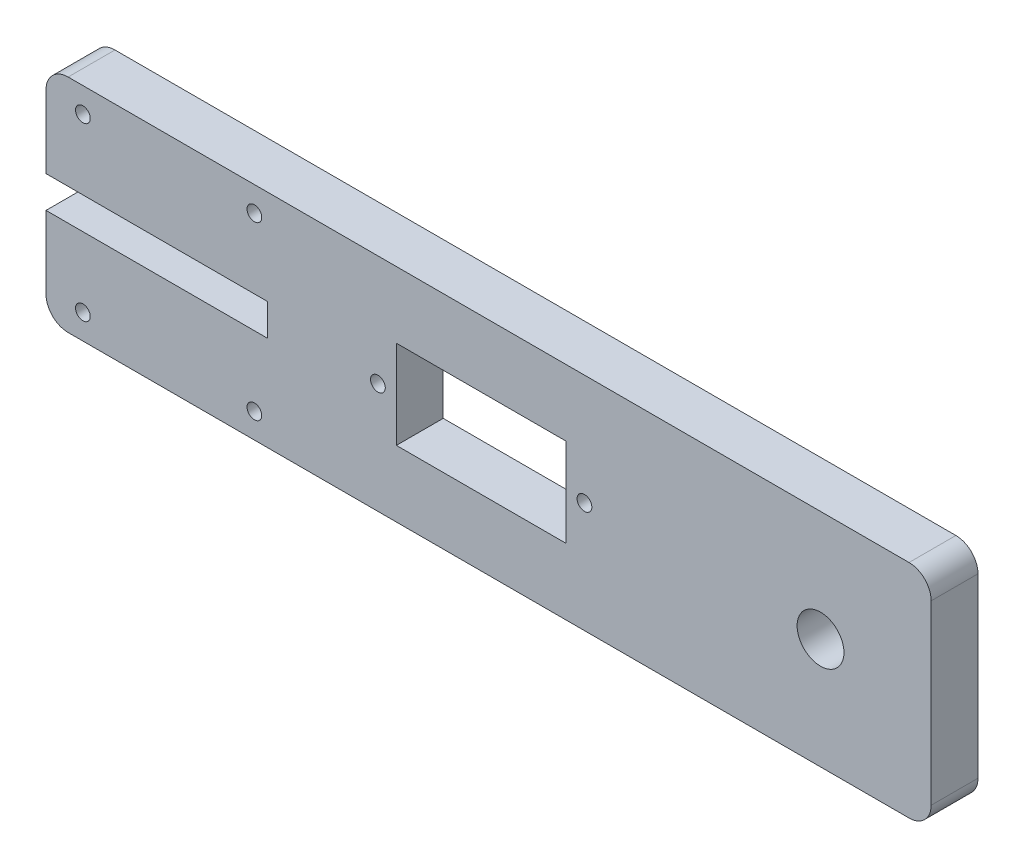
ISO-10303-21;
HEADER;
FILE_DESCRIPTION(('STEP AP214'),'2;1');
FILE_NAME('part.step','',(''),(''),'','','');
FILE_SCHEMA(('AUTOMOTIVE_DESIGN { 1 0 10303 214 1 1 1 1 }'));
ENDSEC;
DATA;
#1=APPLICATION_CONTEXT('core data for automotive mechanical design processes');
#2=APPLICATION_PROTOCOL_DEFINITION('international standard','automotive_design',2000,#1);
#3=PRODUCT_CONTEXT('',#1,'mechanical');
#4=PRODUCT('Part','Part','',(#3));
#5=PRODUCT_RELATED_PRODUCT_CATEGORY('part','',(#4));
#6=PRODUCT_DEFINITION_FORMATION('','',#4);
#7=PRODUCT_DEFINITION_CONTEXT('part definition',#1,'design');
#8=PRODUCT_DEFINITION('design','',#6,#7);
#9=PRODUCT_DEFINITION_SHAPE('','',#8);
#10=(LENGTH_UNIT() NAMED_UNIT(*) SI_UNIT(.MILLI.,.METRE.));
#11=(NAMED_UNIT(*) PLANE_ANGLE_UNIT() SI_UNIT($,.RADIAN.));
#12=(NAMED_UNIT(*) SI_UNIT($,.STERADIAN.) SOLID_ANGLE_UNIT());
#13=UNCERTAINTY_MEASURE_WITH_UNIT(LENGTH_MEASURE(1.E-05),#10,'distance_accuracy_value','');
#14=(GEOMETRIC_REPRESENTATION_CONTEXT(3) GLOBAL_UNCERTAINTY_ASSIGNED_CONTEXT((#13)) GLOBAL_UNIT_ASSIGNED_CONTEXT((#10,
#11,#12)) REPRESENTATION_CONTEXT('',''));
#15=CARTESIAN_POINT('',(0.,0.,0.));
#16=DIRECTION('',(0.,0.,1.));
#17=DIRECTION('',(1.,0.,0.));
#18=AXIS2_PLACEMENT_3D('',#15,#16,#17);
#19=CARTESIAN_POINT('',(0.,0.,6.35));
#20=DIRECTION('',(1.,0.,0.));
#21=DIRECTION('',(0.,0.,-1.));
#22=AXIS2_PLACEMENT_3D('',#19,#20,#21);
#23=PLANE('',#22);
#24=DIRECTION('',(0.,-1.,0.));
#25=VECTOR('',#24,1.);
#26=CARTESIAN_POINT('',(0.,0.,0.));
#27=LINE('',#26,#25);
#28=CARTESIAN_POINT('',(0.,12.841,0.));
#29=VERTEX_POINT('',#28);
#30=CARTESIAN_POINT('',(0.,3.,0.));
#31=VERTEX_POINT('',#30);
#32=EDGE_CURVE('E231',#29,#31,#27,.T.);
#33=ORIENTED_EDGE('',*,*,#32,.T.);
#34=DIRECTION('',(0.,0.,-1.));
#35=VECTOR('',#34,1.);
#36=CARTESIAN_POINT('',(0.,3.,6.35));
#37=LINE('',#36,#35);
#38=CARTESIAN_POINT('',(0.,3.,6.35));
#39=VERTEX_POINT('',#38);
#40=EDGE_CURVE('E290',#31,#39,#37,.F.);
#41=ORIENTED_EDGE('',*,*,#40,.T.);
#42=DIRECTION('',(0.,-1.,0.));
#43=VECTOR('',#42,1.);
#44=CARTESIAN_POINT('',(0.,0.,6.35));
#45=LINE('',#44,#43);
#46=CARTESIAN_POINT('',(0.,12.841,6.35));
#47=VERTEX_POINT('',#46);
#48=EDGE_CURVE('E209',#47,#39,#45,.T.);
#49=ORIENTED_EDGE('',*,*,#48,.F.);
#50=DIRECTION('',(0.,0.,-1.));
#51=VECTOR('',#50,1.);
#52=CARTESIAN_POINT('',(0.,12.841,6.35));
#53=LINE('',#52,#51);
#54=EDGE_CURVE('E230',#47,#29,#53,.T.);
#55=ORIENTED_EDGE('',*,*,#54,.T.);
#56=EDGE_LOOP('',(#33,#41,#49,#55));
#57=FACE_BOUND('',#56,.T.);
#58=ADVANCED_FACE('F37',(#57),#23,.F.);
#59=CARTESIAN_POINT('',(0.,0.,6.35));
#60=DIRECTION('',(0.,1.,0.));
#61=DIRECTION('',(0.,0.,1.));
#62=AXIS2_PLACEMENT_3D('',#59,#60,#61);
#63=PLANE('',#62);
#64=DIRECTION('',(1.,0.,0.));
#65=VECTOR('',#64,1.);
#66=CARTESIAN_POINT('',(0.,0.,6.35));
#67=LINE('',#66,#65);
#68=CARTESIAN_POINT('',(3.,0.,6.35));
#69=VERTEX_POINT('',#68);
#70=CARTESIAN_POINT('',(117.,0.,6.35));
#71=VERTEX_POINT('',#70);
#72=EDGE_CURVE('E212',#69,#71,#67,.T.);
#73=ORIENTED_EDGE('',*,*,#72,.F.);
#74=DIRECTION('',(0.,0.,-1.));
#75=VECTOR('',#74,1.);
#76=CARTESIAN_POINT('',(3.,0.,6.35));
#77=LINE('',#76,#75);
#78=CARTESIAN_POINT('',(3.,0.,0.));
#79=VERTEX_POINT('',#78);
#80=EDGE_CURVE('E287',#69,#79,#77,.T.);
#81=ORIENTED_EDGE('',*,*,#80,.T.);
#82=DIRECTION('',(1.,0.,0.));
#83=VECTOR('',#82,1.);
#84=CARTESIAN_POINT('',(0.,0.,0.));
#85=LINE('',#84,#83);
#86=CARTESIAN_POINT('',(117.,0.,0.));
#87=VERTEX_POINT('',#86);
#88=EDGE_CURVE('E234',#79,#87,#85,.T.);
#89=ORIENTED_EDGE('',*,*,#88,.T.);
#90=DIRECTION('',(0.,0.,-1.));
#91=VECTOR('',#90,1.);
#92=CARTESIAN_POINT('',(117.,0.,6.35));
#93=LINE('',#92,#91);
#94=EDGE_CURVE('E285',#87,#71,#93,.F.);
#95=ORIENTED_EDGE('',*,*,#94,.T.);
#96=EDGE_LOOP('',(#73,#81,#89,#95));
#97=FACE_BOUND('',#96,.T.);
#98=ADVANCED_FACE('F350',(#97),#63,.F.);
#99=CARTESIAN_POINT('',(120.,0.,6.35));
#100=DIRECTION('',(-1.,0.,0.));
#101=DIRECTION('',(0.,0.,1.));
#102=AXIS2_PLACEMENT_3D('',#99,#100,#101);
#103=PLANE('',#102);
#104=DIRECTION('',(0.,1.,0.));
#105=VECTOR('',#104,1.);
#106=CARTESIAN_POINT('',(120.,0.,6.35));
#107=LINE('',#106,#105);
#108=CARTESIAN_POINT('',(120.,3.,6.35));
#109=VERTEX_POINT('',#108);
#110=CARTESIAN_POINT('',(120.,27.,6.35));
#111=VERTEX_POINT('',#110);
#112=EDGE_CURVE('E216',#109,#111,#107,.T.);
#113=ORIENTED_EDGE('',*,*,#112,.F.);
#114=DIRECTION('',(0.,0.,-1.));
#115=VECTOR('',#114,1.);
#116=CARTESIAN_POINT('',(120.,3.,6.35));
#117=LINE('',#116,#115);
#118=CARTESIAN_POINT('',(120.,3.,0.));
#119=VERTEX_POINT('',#118);
#120=EDGE_CURVE('E11',#109,#119,#117,.T.);
#121=ORIENTED_EDGE('',*,*,#120,.T.);
#122=DIRECTION('',(0.,1.,0.));
#123=VECTOR('',#122,1.);
#124=CARTESIAN_POINT('',(120.,0.,0.));
#125=LINE('',#124,#123);
#126=CARTESIAN_POINT('',(120.,27.,0.));
#127=VERTEX_POINT('',#126);
#128=EDGE_CURVE('E237',#119,#127,#125,.T.);
#129=ORIENTED_EDGE('',*,*,#128,.T.);
#130=DIRECTION('',(0.,0.,-1.));
#131=VECTOR('',#130,1.);
#132=CARTESIAN_POINT('',(120.,27.,6.35));
#133=LINE('',#132,#131);
#134=EDGE_CURVE('E46',#127,#111,#133,.F.);
#135=ORIENTED_EDGE('',*,*,#134,.T.);
#136=EDGE_LOOP('',(#113,#121,#129,#135));
#137=FACE_BOUND('',#136,.T.);
#138=ADVANCED_FACE('F341',(#137),#103,.F.);
#139=CARTESIAN_POINT('',(0.,30.,6.35));
#140=DIRECTION('',(0.,-1.,0.));
#141=DIRECTION('',(0.,0.,-1.));
#142=AXIS2_PLACEMENT_3D('',#139,#140,#141);
#143=PLANE('',#142);
#144=DIRECTION('',(-1.,0.,0.));
#145=VECTOR('',#144,1.);
#146=CARTESIAN_POINT('',(0.,30.,0.));
#147=LINE('',#146,#145);
#148=CARTESIAN_POINT('',(117.,30.,0.));
#149=VERTEX_POINT('',#148);
#150=CARTESIAN_POINT('',(3.,30.,0.));
#151=VERTEX_POINT('',#150);
#152=EDGE_CURVE('E240',#149,#151,#147,.T.);
#153=ORIENTED_EDGE('',*,*,#152,.T.);
#154=DIRECTION('',(0.,0.,-1.));
#155=VECTOR('',#154,1.);
#156=CARTESIAN_POINT('',(3.,30.,6.35));
#157=LINE('',#156,#155);
#158=CARTESIAN_POINT('',(3.,30.,6.35));
#159=VERTEX_POINT('',#158);
#160=EDGE_CURVE('E275',#151,#159,#157,.F.);
#161=ORIENTED_EDGE('',*,*,#160,.T.);
#162=DIRECTION('',(-1.,0.,0.));
#163=VECTOR('',#162,1.);
#164=CARTESIAN_POINT('',(0.,30.,6.35));
#165=LINE('',#164,#163);
#166=CARTESIAN_POINT('',(117.,30.,6.35));
#167=VERTEX_POINT('',#166);
#168=EDGE_CURVE('E219',#167,#159,#165,.T.);
#169=ORIENTED_EDGE('',*,*,#168,.F.);
#170=DIRECTION('',(0.,0.,-1.));
#171=VECTOR('',#170,1.);
#172=CARTESIAN_POINT('',(117.,30.,6.35));
#173=LINE('',#172,#171);
#174=EDGE_CURVE('E272',#167,#149,#173,.T.);
#175=ORIENTED_EDGE('',*,*,#174,.T.);
#176=EDGE_LOOP('',(#153,#161,#169,#175));
#177=FACE_BOUND('',#176,.T.);
#178=ADVANCED_FACE('F333',(#177),#143,.F.);
#179=CARTESIAN_POINT('',(0.,17.159,6.35));
#180=DIRECTION('',(1.,0.,0.));
#181=DIRECTION('',(0.,0.,-1.));
#182=AXIS2_PLACEMENT_3D('',#179,#180,#181);
#183=PLANE('',#182);
#184=DIRECTION('',(0.,-1.,0.));
#185=VECTOR('',#184,1.);
#186=CARTESIAN_POINT('',(0.,17.159,6.35));
#187=LINE('',#186,#185);
#188=CARTESIAN_POINT('',(0.,27.,6.35));
#189=VERTEX_POINT('',#188);
#190=CARTESIAN_POINT('',(0.,17.159,6.35));
#191=VERTEX_POINT('',#190);
#192=EDGE_CURVE('E222',#189,#191,#187,.T.);
#193=ORIENTED_EDGE('',*,*,#192,.F.);
#194=DIRECTION('',(0.,0.,-1.));
#195=VECTOR('',#194,1.);
#196=CARTESIAN_POINT('',(0.,27.,6.35));
#197=LINE('',#196,#195);
#198=CARTESIAN_POINT('',(0.,27.,0.));
#199=VERTEX_POINT('',#198);
#200=EDGE_CURVE('E261',#189,#199,#197,.T.);
#201=ORIENTED_EDGE('',*,*,#200,.T.);
#202=DIRECTION('',(0.,-1.,0.));
#203=VECTOR('',#202,1.);
#204=CARTESIAN_POINT('',(0.,17.159,0.));
#205=LINE('',#204,#203);
#206=CARTESIAN_POINT('',(0.,17.159,0.));
#207=VERTEX_POINT('',#206);
#208=EDGE_CURVE('E243',#199,#207,#205,.T.);
#209=ORIENTED_EDGE('',*,*,#208,.T.);
#210=DIRECTION('',(0.,0.,-1.));
#211=VECTOR('',#210,1.);
#212=CARTESIAN_POINT('',(0.,17.159,6.35));
#213=LINE('',#212,#211);
#214=EDGE_CURVE('E258',#191,#207,#213,.T.);
#215=ORIENTED_EDGE('',*,*,#214,.F.);
#216=EDGE_LOOP('',(#193,#201,#209,#215));
#217=FACE_BOUND('',#216,.T.);
#218=ADVANCED_FACE('F319',(#217),#183,.F.);
#219=CARTESIAN_POINT('',(0.,17.159,6.35));
#220=DIRECTION('',(0.,1.,0.));
#221=DIRECTION('',(0.,0.,1.));
#222=AXIS2_PLACEMENT_3D('',#219,#220,#221);
#223=PLANE('',#222);
#224=DIRECTION('',(1.,0.,0.));
#225=VECTOR('',#224,1.);
#226=CARTESIAN_POINT('',(0.,17.159,0.));
#227=LINE('',#226,#225);
#228=CARTESIAN_POINT('',(30.,17.159,0.));
#229=VERTEX_POINT('',#228);
#230=EDGE_CURVE('E245',#207,#229,#227,.T.);
#231=ORIENTED_EDGE('',*,*,#230,.T.);
#232=DIRECTION('',(0.,0.,-1.));
#233=VECTOR('',#232,1.);
#234=CARTESIAN_POINT('',(30.,17.159,6.35));
#235=LINE('',#234,#233);
#236=CARTESIAN_POINT('',(30.,17.159,6.35));
#237=VERTEX_POINT('',#236);
#238=EDGE_CURVE('E255',#237,#229,#235,.T.);
#239=ORIENTED_EDGE('',*,*,#238,.F.);
#240=DIRECTION('',(1.,0.,0.));
#241=VECTOR('',#240,1.);
#242=CARTESIAN_POINT('',(0.,17.159,6.35));
#243=LINE('',#242,#241);
#244=EDGE_CURVE('E224',#191,#237,#243,.T.);
#245=ORIENTED_EDGE('',*,*,#244,.F.);
#246=ORIENTED_EDGE('',*,*,#214,.T.);
#247=EDGE_LOOP('',(#231,#239,#245,#246));
#248=FACE_BOUND('',#247,.T.);
#249=ADVANCED_FACE('F323',(#248),#223,.F.);
#250=CARTESIAN_POINT('',(30.,17.159,6.35));
#251=DIRECTION('',(1.,0.,0.));
#252=DIRECTION('',(0.,0.,-1.));
#253=AXIS2_PLACEMENT_3D('',#250,#251,#252);
#254=PLANE('',#253);
#255=DIRECTION('',(0.,-1.,0.));
#256=VECTOR('',#255,1.);
#257=CARTESIAN_POINT('',(30.,17.159,0.));
#258=LINE('',#257,#256);
#259=CARTESIAN_POINT('',(30.,12.841,0.));
#260=VERTEX_POINT('',#259);
#261=EDGE_CURVE('E247',#229,#260,#258,.T.);
#262=ORIENTED_EDGE('',*,*,#261,.T.);
#263=DIRECTION('',(0.,0.,-1.));
#264=VECTOR('',#263,1.);
#265=CARTESIAN_POINT('',(30.,12.841,6.35));
#266=LINE('',#265,#264);
#267=CARTESIAN_POINT('',(30.,12.841,6.35));
#268=VERTEX_POINT('',#267);
#269=EDGE_CURVE('E252',#268,#260,#266,.T.);
#270=ORIENTED_EDGE('',*,*,#269,.F.);
#271=DIRECTION('',(0.,-1.,0.));
#272=VECTOR('',#271,1.);
#273=CARTESIAN_POINT('',(30.,17.159,6.35));
#274=LINE('',#273,#272);
#275=EDGE_CURVE('E226',#237,#268,#274,.T.);
#276=ORIENTED_EDGE('',*,*,#275,.F.);
#277=ORIENTED_EDGE('',*,*,#238,.T.);
#278=EDGE_LOOP('',(#262,#270,#276,#277));
#279=FACE_BOUND('',#278,.T.);
#280=ADVANCED_FACE('F365',(#279),#254,.F.);
#281=CARTESIAN_POINT('',(0.,12.841,6.35));
#282=DIRECTION('',(0.,-1.,0.));
#283=DIRECTION('',(0.,0.,-1.));
#284=AXIS2_PLACEMENT_3D('',#281,#282,#283);
#285=PLANE('',#284);
#286=DIRECTION('',(-1.,0.,0.));
#287=VECTOR('',#286,1.);
#288=CARTESIAN_POINT('',(0.,12.841,0.));
#289=LINE('',#288,#287);
#290=EDGE_CURVE('E213',#260,#29,#289,.T.);
#291=ORIENTED_EDGE('',*,*,#290,.T.);
#292=ORIENTED_EDGE('',*,*,#54,.F.);
#293=DIRECTION('',(-1.,0.,0.));
#294=VECTOR('',#293,1.);
#295=CARTESIAN_POINT('',(0.,12.841,6.35));
#296=LINE('',#295,#294);
#297=EDGE_CURVE('E228',#268,#47,#296,.T.);
#298=ORIENTED_EDGE('',*,*,#297,.F.);
#299=ORIENTED_EDGE('',*,*,#269,.T.);
#300=EDGE_LOOP('',(#291,#292,#298,#299));
#301=FACE_BOUND('',#300,.T.);
#302=ADVANCED_FACE('F363',(#301),#285,.F.);
#303=CARTESIAN_POINT('',(0.,12.841,6.35));
#304=DIRECTION('',(0.,0.,-1.));
#305=DIRECTION('',(-1.,0.,0.));
#306=AXIS2_PLACEMENT_3D('',#303,#304,#305);
#307=PLANE('',#306);
#308=CARTESIAN_POINT('',(105.,15.,6.35));
#309=DIRECTION('',(0.,0.,1.));
#310=DIRECTION('',(1.,0.,0.));
#311=AXIS2_PLACEMENT_3D('',#308,#309,#310);
#312=CIRCLE('',#311,3.175);
#313=CARTESIAN_POINT('',(108.175,15.,6.35));
#314=VERTEX_POINT('',#313);
#315=EDGE_CURVE('E411',#314,#314,#312,.T.);
#316=ORIENTED_EDGE('',*,*,#315,.F.);
#317=EDGE_LOOP('',(#316));
#318=FACE_BOUND('',#317,.T.);
#319=CARTESIAN_POINT('',(45.,15.,6.35));
#320=DIRECTION('',(0.,0.,1.));
#321=DIRECTION('',(1.,0.,0.));
#322=AXIS2_PLACEMENT_3D('',#319,#320,#321);
#323=CIRCLE('',#322,0.996949999999996);
#324=CARTESIAN_POINT('',(45.99695,15.,6.35));
#325=VERTEX_POINT('',#324);
#326=EDGE_CURVE('E415',#325,#325,#323,.T.);
#327=ORIENTED_EDGE('',*,*,#326,.F.);
#328=EDGE_LOOP('',(#327));
#329=FACE_BOUND('',#328,.T.);
#330=CARTESIAN_POINT('',(73.,15.,6.35));
#331=DIRECTION('',(0.,0.,1.));
#332=DIRECTION('',(1.,0.,0.));
#333=AXIS2_PLACEMENT_3D('',#330,#331,#332);
#334=CIRCLE('',#333,0.996949999999996);
#335=CARTESIAN_POINT('',(73.99695,15.,6.35));
#336=VERTEX_POINT('',#335);
#337=EDGE_CURVE('E419',#336,#336,#334,.T.);
#338=ORIENTED_EDGE('',*,*,#337,.F.);
#339=EDGE_LOOP('',(#338));
#340=FACE_BOUND('',#339,.T.);
#341=DIRECTION('',(1.,0.,0.));
#342=VECTOR('',#341,1.);
#343=CARTESIAN_POINT('',(47.5,9.,6.35));
#344=LINE('',#343,#342);
#345=CARTESIAN_POINT('',(47.5,9.,6.35));
#346=VERTEX_POINT('',#345);
#347=CARTESIAN_POINT('',(70.5,9.,6.35));
#348=VERTEX_POINT('',#347);
#349=EDGE_CURVE('E182',#346,#348,#344,.T.);
#350=ORIENTED_EDGE('',*,*,#349,.F.);
#351=DIRECTION('',(0.,-1.,0.));
#352=VECTOR('',#351,1.);
#353=CARTESIAN_POINT('',(47.5,21.,6.35));
#354=LINE('',#353,#352);
#355=CARTESIAN_POINT('',(47.5,21.,6.35));
#356=VERTEX_POINT('',#355);
#357=EDGE_CURVE('E54',#356,#346,#354,.T.);
#358=ORIENTED_EDGE('',*,*,#357,.F.);
#359=DIRECTION('',(-1.,0.,0.));
#360=VECTOR('',#359,1.);
#361=CARTESIAN_POINT('',(47.5,21.,6.35));
#362=LINE('',#361,#360);
#363=CARTESIAN_POINT('',(70.5,21.,6.35));
#364=VERTEX_POINT('',#363);
#365=EDGE_CURVE('E170',#364,#356,#362,.T.);
#366=ORIENTED_EDGE('',*,*,#365,.F.);
#367=DIRECTION('',(0.,1.,0.));
#368=VECTOR('',#367,1.);
#369=CARTESIAN_POINT('',(70.5,21.,6.35));
#370=LINE('',#369,#368);
#371=EDGE_CURVE('E173',#348,#364,#370,.T.);
#372=ORIENTED_EDGE('',*,*,#371,.F.);
#373=EDGE_LOOP('',(#350,#358,#366,#372));
#374=FACE_BOUND('',#373,.T.);
#375=CARTESIAN_POINT('',(4.99999999999999,26.625,6.35));
#376=DIRECTION('',(0.,0.,1.));
#377=DIRECTION('',(1.,0.,0.));
#378=AXIS2_PLACEMENT_3D('',#375,#376,#377);
#379=CIRCLE('',#378,0.996949999999998);
#380=CARTESIAN_POINT('',(5.99694999999999,26.625,6.35));
#381=VERTEX_POINT('',#380);
#382=EDGE_CURVE('E188',#381,#381,#379,.T.);
#383=ORIENTED_EDGE('',*,*,#382,.F.);
#384=EDGE_LOOP('',(#383));
#385=FACE_BOUND('',#384,.T.);
#386=CARTESIAN_POINT('',(28.25,26.625,6.35));
#387=DIRECTION('',(0.,0.,1.));
#388=DIRECTION('',(1.,0.,0.));
#389=AXIS2_PLACEMENT_3D('',#386,#387,#388);
#390=CIRCLE('',#389,0.99695);
#391=CARTESIAN_POINT('',(29.24695,26.625,6.35));
#392=VERTEX_POINT('',#391);
#393=EDGE_CURVE('E197',#392,#392,#390,.T.);
#394=ORIENTED_EDGE('',*,*,#393,.F.);
#395=EDGE_LOOP('',(#394));
#396=FACE_BOUND('',#395,.T.);
#397=CARTESIAN_POINT('',(28.25,3.375,6.35));
#398=DIRECTION('',(0.,0.,1.));
#399=DIRECTION('',(1.,0.,0.));
#400=AXIS2_PLACEMENT_3D('',#397,#398,#399);
#401=CIRCLE('',#400,0.99695);
#402=CARTESIAN_POINT('',(29.24695,3.375,6.35));
#403=VERTEX_POINT('',#402);
#404=EDGE_CURVE('E201',#403,#403,#401,.T.);
#405=ORIENTED_EDGE('',*,*,#404,.F.);
#406=EDGE_LOOP('',(#405));
#407=FACE_BOUND('',#406,.T.);
#408=CARTESIAN_POINT('',(4.99999999999999,3.375,6.35));
#409=DIRECTION('',(0.,0.,1.));
#410=DIRECTION('',(1.,0.,0.));
#411=AXIS2_PLACEMENT_3D('',#408,#409,#410);
#412=CIRCLE('',#411,0.996949999999998);
#413=CARTESIAN_POINT('',(5.99694999999999,3.375,6.35));
#414=VERTEX_POINT('',#413);
#415=EDGE_CURVE('E205',#414,#414,#412,.T.);
#416=ORIENTED_EDGE('',*,*,#415,.F.);
#417=EDGE_LOOP('',(#416));
#418=FACE_BOUND('',#417,.T.);
#419=ORIENTED_EDGE('',*,*,#168,.T.);
#420=CARTESIAN_POINT('',(3.,27.,6.35));
#421=DIRECTION('',(0.,0.,-1.));
#422=DIRECTION('',(-1.,0.,0.));
#423=AXIS2_PLACEMENT_3D('',#420,#421,#422);
#424=CIRCLE('',#423,3.);
#425=EDGE_CURVE('E283',#159,#189,#424,.F.);
#426=ORIENTED_EDGE('',*,*,#425,.T.);
#427=ORIENTED_EDGE('',*,*,#192,.T.);
#428=ORIENTED_EDGE('',*,*,#244,.T.);
#429=ORIENTED_EDGE('',*,*,#275,.T.);
#430=ORIENTED_EDGE('',*,*,#297,.T.);
#431=ORIENTED_EDGE('',*,*,#48,.T.);
#432=CARTESIAN_POINT('',(3.,3.,6.35));
#433=DIRECTION('',(0.,0.,-1.));
#434=DIRECTION('',(-1.,0.,0.));
#435=AXIS2_PLACEMENT_3D('',#432,#433,#434);
#436=CIRCLE('',#435,3.);
#437=EDGE_CURVE('E281',#39,#69,#436,.F.);
#438=ORIENTED_EDGE('',*,*,#437,.T.);
#439=ORIENTED_EDGE('',*,*,#72,.T.);
#440=CARTESIAN_POINT('',(117.,3.,6.35));
#441=DIRECTION('',(0.,0.,-1.));
#442=DIRECTION('',(-1.,0.,0.));
#443=AXIS2_PLACEMENT_3D('',#440,#441,#442);
#444=CIRCLE('',#443,3.);
#445=EDGE_CURVE('E279',#71,#109,#444,.F.);
#446=ORIENTED_EDGE('',*,*,#445,.T.);
#447=ORIENTED_EDGE('',*,*,#112,.T.);
#448=CARTESIAN_POINT('',(117.,27.,6.35));
#449=DIRECTION('',(0.,0.,-1.));
#450=DIRECTION('',(-1.,0.,0.));
#451=AXIS2_PLACEMENT_3D('',#448,#449,#450);
#452=CIRCLE('',#451,3.);
#453=EDGE_CURVE('E277',#111,#167,#452,.F.);
#454=ORIENTED_EDGE('',*,*,#453,.T.);
#455=EDGE_LOOP('',(#419,#426,#427,#428,#429,#430,#431,#438,#439,#446,#447,#454));
#456=FACE_BOUND('',#455,.T.);
#457=ADVANCED_FACE('F305',(#318,#329,#340,#374,#385,#396,#407,#418,#456),#307,.F.);
#458=CARTESIAN_POINT('',(0.,12.841,0.));
#459=DIRECTION('',(0.,0.,-1.));
#460=DIRECTION('',(-1.,0.,0.));
#461=AXIS2_PLACEMENT_3D('',#458,#459,#460);
#462=PLANE('',#461);
#463=CARTESIAN_POINT('',(105.,15.,0.));
#464=DIRECTION('',(0.,0.,-1.));
#465=DIRECTION('',(-1.,0.,0.));
#466=AXIS2_PLACEMENT_3D('',#463,#464,#465);
#467=CIRCLE('',#466,3.175);
#468=CARTESIAN_POINT('',(101.825,15.,0.));
#469=VERTEX_POINT('',#468);
#470=EDGE_CURVE('E41',#469,#469,#467,.T.);
#471=ORIENTED_EDGE('',*,*,#470,.F.);
#472=EDGE_LOOP('',(#471));
#473=FACE_BOUND('',#472,.T.);
#474=CARTESIAN_POINT('',(45.,15.,0.));
#475=DIRECTION('',(0.,0.,1.));
#476=DIRECTION('',(1.,0.,0.));
#477=AXIS2_PLACEMENT_3D('',#474,#475,#476);
#478=CIRCLE('',#477,0.996949999999996);
#479=CARTESIAN_POINT('',(45.99695,15.,0.));
#480=VERTEX_POINT('',#479);
#481=EDGE_CURVE('E468',#480,#480,#478,.T.);
#482=ORIENTED_EDGE('',*,*,#481,.T.);
#483=EDGE_LOOP('',(#482));
#484=FACE_BOUND('',#483,.T.);
#485=CARTESIAN_POINT('',(73.,15.,0.));
#486=DIRECTION('',(0.,0.,1.));
#487=DIRECTION('',(1.,0.,0.));
#488=AXIS2_PLACEMENT_3D('',#485,#486,#487);
#489=CIRCLE('',#488,0.996949999999996);
#490=CARTESIAN_POINT('',(73.99695,15.,0.));
#491=VERTEX_POINT('',#490);
#492=EDGE_CURVE('E176',#491,#491,#489,.T.);
#493=ORIENTED_EDGE('',*,*,#492,.T.);
#494=EDGE_LOOP('',(#493));
#495=FACE_BOUND('',#494,.T.);
#496=DIRECTION('',(0.,-1.,0.));
#497=VECTOR('',#496,1.);
#498=CARTESIAN_POINT('',(47.5,21.,0.));
#499=LINE('',#498,#497);
#500=CARTESIAN_POINT('',(47.5,21.,0.));
#501=VERTEX_POINT('',#500);
#502=CARTESIAN_POINT('',(47.5,9.,0.));
#503=VERTEX_POINT('',#502);
#504=EDGE_CURVE('E154',#501,#503,#499,.T.);
#505=ORIENTED_EDGE('',*,*,#504,.T.);
#506=DIRECTION('',(1.,0.,0.));
#507=VECTOR('',#506,1.);
#508=CARTESIAN_POINT('',(47.5,9.,0.));
#509=LINE('',#508,#507);
#510=CARTESIAN_POINT('',(70.5,9.,0.));
#511=VERTEX_POINT('',#510);
#512=EDGE_CURVE('E163',#503,#511,#509,.T.);
#513=ORIENTED_EDGE('',*,*,#512,.T.);
#514=DIRECTION('',(0.,1.,0.));
#515=VECTOR('',#514,1.);
#516=CARTESIAN_POINT('',(70.5,21.,0.));
#517=LINE('',#516,#515);
#518=CARTESIAN_POINT('',(70.5,21.,0.));
#519=VERTEX_POINT('',#518);
#520=EDGE_CURVE('E62',#511,#519,#517,.T.);
#521=ORIENTED_EDGE('',*,*,#520,.T.);
#522=DIRECTION('',(-1.,0.,0.));
#523=VECTOR('',#522,1.);
#524=CARTESIAN_POINT('',(47.5,21.,0.));
#525=LINE('',#524,#523);
#526=EDGE_CURVE('E160',#519,#501,#525,.T.);
#527=ORIENTED_EDGE('',*,*,#526,.T.);
#528=EDGE_LOOP('',(#505,#513,#521,#527));
#529=FACE_BOUND('',#528,.T.);
#530=CARTESIAN_POINT('',(4.99999999999999,26.625,0.));
#531=DIRECTION('',(0.,0.,-1.));
#532=DIRECTION('',(-1.,0.,0.));
#533=AXIS2_PLACEMENT_3D('',#530,#531,#532);
#534=CIRCLE('',#533,0.996949999999998);
#535=CARTESIAN_POINT('',(4.00305,26.625,0.));
#536=VERTEX_POINT('',#535);
#537=EDGE_CURVE('E194',#536,#536,#534,.T.);
#538=ORIENTED_EDGE('',*,*,#537,.F.);
#539=EDGE_LOOP('',(#538));
#540=FACE_BOUND('',#539,.T.);
#541=CARTESIAN_POINT('',(28.25,26.625,0.));
#542=DIRECTION('',(0.,0.,-1.));
#543=DIRECTION('',(-1.,0.,0.));
#544=AXIS2_PLACEMENT_3D('',#541,#542,#543);
#545=CIRCLE('',#544,0.996949999999998);
#546=CARTESIAN_POINT('',(27.25305,26.625,0.));
#547=VERTEX_POINT('',#546);
#548=EDGE_CURVE('E200',#547,#547,#545,.T.);
#549=ORIENTED_EDGE('',*,*,#548,.F.);
#550=EDGE_LOOP('',(#549));
#551=FACE_BOUND('',#550,.T.);
#552=CARTESIAN_POINT('',(28.25,3.375,0.));
#553=DIRECTION('',(0.,0.,-1.));
#554=DIRECTION('',(-1.,0.,0.));
#555=AXIS2_PLACEMENT_3D('',#552,#553,#554);
#556=CIRCLE('',#555,0.996949999999998);
#557=CARTESIAN_POINT('',(27.25305,3.375,0.));
#558=VERTEX_POINT('',#557);
#559=EDGE_CURVE('E204',#558,#558,#556,.T.);
#560=ORIENTED_EDGE('',*,*,#559,.F.);
#561=EDGE_LOOP('',(#560));
#562=FACE_BOUND('',#561,.T.);
#563=CARTESIAN_POINT('',(4.99999999999999,3.375,0.));
#564=DIRECTION('',(0.,0.,-1.));
#565=DIRECTION('',(-1.,0.,0.));
#566=AXIS2_PLACEMENT_3D('',#563,#564,#565);
#567=CIRCLE('',#566,0.996949999999998);
#568=CARTESIAN_POINT('',(4.00305,3.375,0.));
#569=VERTEX_POINT('',#568);
#570=EDGE_CURVE('E208',#569,#569,#567,.T.);
#571=ORIENTED_EDGE('',*,*,#570,.F.);
#572=EDGE_LOOP('',(#571));
#573=FACE_BOUND('',#572,.T.);
#574=ORIENTED_EDGE('',*,*,#208,.F.);
#575=CARTESIAN_POINT('',(3.,27.,0.));
#576=DIRECTION('',(0.,0.,-1.));
#577=DIRECTION('',(-1.,0.,0.));
#578=AXIS2_PLACEMENT_3D('',#575,#576,#577);
#579=CIRCLE('',#578,3.);
#580=EDGE_CURVE('E270',#199,#151,#579,.T.);
#581=ORIENTED_EDGE('',*,*,#580,.T.);
#582=ORIENTED_EDGE('',*,*,#152,.F.);
#583=CARTESIAN_POINT('',(117.,27.,0.));
#584=DIRECTION('',(0.,0.,-1.));
#585=DIRECTION('',(-1.,0.,0.));
#586=AXIS2_PLACEMENT_3D('',#583,#584,#585);
#587=CIRCLE('',#586,3.);
#588=EDGE_CURVE('E264',#149,#127,#587,.T.);
#589=ORIENTED_EDGE('',*,*,#588,.T.);
#590=ORIENTED_EDGE('',*,*,#128,.F.);
#591=CARTESIAN_POINT('',(117.,3.,0.));
#592=DIRECTION('',(0.,0.,-1.));
#593=DIRECTION('',(-1.,0.,0.));
#594=AXIS2_PLACEMENT_3D('',#591,#592,#593);
#595=CIRCLE('',#594,3.);
#596=EDGE_CURVE('E266',#119,#87,#595,.T.);
#597=ORIENTED_EDGE('',*,*,#596,.T.);
#598=ORIENTED_EDGE('',*,*,#88,.F.);
#599=CARTESIAN_POINT('',(3.,3.,0.));
#600=DIRECTION('',(0.,0.,-1.));
#601=DIRECTION('',(-1.,0.,0.));
#602=AXIS2_PLACEMENT_3D('',#599,#600,#601);
#603=CIRCLE('',#602,3.);
#604=EDGE_CURVE('E268',#79,#31,#603,.T.);
#605=ORIENTED_EDGE('',*,*,#604,.T.);
#606=ORIENTED_EDGE('',*,*,#32,.F.);
#607=ORIENTED_EDGE('',*,*,#290,.F.);
#608=ORIENTED_EDGE('',*,*,#261,.F.);
#609=ORIENTED_EDGE('',*,*,#230,.F.);
#610=EDGE_LOOP('',(#574,#581,#582,#589,#590,#597,#598,#605,#606,#607,#608,#609));
#611=FACE_BOUND('',#610,.T.);
#612=ADVANCED_FACE('F167',(#473,#484,#495,#529,#540,#551,#562,#573,#611),#462,.T.);
#613=CARTESIAN_POINT('',(3.,27.,6.35));
#614=DIRECTION('',(0.,0.,-1.));
#615=DIRECTION('',(-1.,0.,0.));
#616=AXIS2_PLACEMENT_3D('',#613,#614,#615);
#617=CYLINDRICAL_SURFACE('',#616,3.);
#618=ORIENTED_EDGE('',*,*,#425,.F.);
#619=ORIENTED_EDGE('',*,*,#160,.F.);
#620=ORIENTED_EDGE('',*,*,#580,.F.);
#621=ORIENTED_EDGE('',*,*,#200,.F.);
#622=EDGE_LOOP('',(#618,#619,#620,#621));
#623=FACE_BOUND('',#622,.T.);
#624=ADVANCED_FACE('F304',(#623),#617,.T.);
#625=CARTESIAN_POINT('',(3.,3.,6.35));
#626=DIRECTION('',(0.,0.,-1.));
#627=DIRECTION('',(-1.,0.,0.));
#628=AXIS2_PLACEMENT_3D('',#625,#626,#627);
#629=CYLINDRICAL_SURFACE('',#628,3.);
#630=ORIENTED_EDGE('',*,*,#437,.F.);
#631=ORIENTED_EDGE('',*,*,#40,.F.);
#632=ORIENTED_EDGE('',*,*,#604,.F.);
#633=ORIENTED_EDGE('',*,*,#80,.F.);
#634=EDGE_LOOP('',(#630,#631,#632,#633));
#635=FACE_BOUND('',#634,.T.);
#636=ADVANCED_FACE('F354',(#635),#629,.T.);
#637=CARTESIAN_POINT('',(117.,3.,6.35));
#638=DIRECTION('',(0.,0.,-1.));
#639=DIRECTION('',(-1.,0.,0.));
#640=AXIS2_PLACEMENT_3D('',#637,#638,#639);
#641=CYLINDRICAL_SURFACE('',#640,3.);
#642=ORIENTED_EDGE('',*,*,#445,.F.);
#643=ORIENTED_EDGE('',*,*,#94,.F.);
#644=ORIENTED_EDGE('',*,*,#596,.F.);
#645=ORIENTED_EDGE('',*,*,#120,.F.);
#646=EDGE_LOOP('',(#642,#643,#644,#645));
#647=FACE_BOUND('',#646,.T.);
#648=ADVANCED_FACE('F345',(#647),#641,.T.);
#649=CARTESIAN_POINT('',(117.,27.,6.35));
#650=DIRECTION('',(0.,0.,-1.));
#651=DIRECTION('',(-1.,0.,0.));
#652=AXIS2_PLACEMENT_3D('',#649,#650,#651);
#653=CYLINDRICAL_SURFACE('',#652,3.);
#654=ORIENTED_EDGE('',*,*,#453,.F.);
#655=ORIENTED_EDGE('',*,*,#134,.F.);
#656=ORIENTED_EDGE('',*,*,#588,.F.);
#657=ORIENTED_EDGE('',*,*,#174,.F.);
#658=EDGE_LOOP('',(#654,#655,#656,#657));
#659=FACE_BOUND('',#658,.T.);
#660=ADVANCED_FACE('F39',(#659),#653,.T.);
#661=CARTESIAN_POINT('',(4.99999999999999,3.375,6.35));
#662=DIRECTION('',(0.,0.,1.));
#663=DIRECTION('',(1.,0.,0.));
#664=AXIS2_PLACEMENT_3D('',#661,#662,#663);
#665=CYLINDRICAL_SURFACE('',#664,0.996949999999998);
#666=ORIENTED_EDGE('',*,*,#570,.T.);
#667=EDGE_LOOP('',(#666));
#668=FACE_BOUND('',#667,.T.);
#669=ORIENTED_EDGE('',*,*,#415,.T.);
#670=EDGE_LOOP('',(#669));
#671=FACE_BOUND('',#670,.T.);
#672=ADVANCED_FACE('F389',(#668,#671),#665,.F.);
#673=CARTESIAN_POINT('',(28.25,3.375,6.35));
#674=DIRECTION('',(0.,0.,1.));
#675=DIRECTION('',(1.,0.,0.));
#676=AXIS2_PLACEMENT_3D('',#673,#674,#675);
#677=CYLINDRICAL_SURFACE('',#676,0.996949999999998);
#678=ORIENTED_EDGE('',*,*,#559,.T.);
#679=EDGE_LOOP('',(#678));
#680=FACE_BOUND('',#679,.T.);
#681=ORIENTED_EDGE('',*,*,#404,.T.);
#682=EDGE_LOOP('',(#681));
#683=FACE_BOUND('',#682,.T.);
#684=ADVANCED_FACE('F393',(#680,#683),#677,.F.);
#685=CARTESIAN_POINT('',(28.25,26.625,6.35));
#686=DIRECTION('',(0.,0.,1.));
#687=DIRECTION('',(1.,0.,0.));
#688=AXIS2_PLACEMENT_3D('',#685,#686,#687);
#689=CYLINDRICAL_SURFACE('',#688,0.996949999999998);
#690=ORIENTED_EDGE('',*,*,#548,.T.);
#691=EDGE_LOOP('',(#690));
#692=FACE_BOUND('',#691,.T.);
#693=ORIENTED_EDGE('',*,*,#393,.T.);
#694=EDGE_LOOP('',(#693));
#695=FACE_BOUND('',#694,.T.);
#696=ADVANCED_FACE('F299',(#692,#695),#689,.F.);
#697=CARTESIAN_POINT('',(4.99999999999999,26.625,6.35));
#698=DIRECTION('',(0.,0.,1.));
#699=DIRECTION('',(1.,0.,0.));
#700=AXIS2_PLACEMENT_3D('',#697,#698,#699);
#701=CYLINDRICAL_SURFACE('',#700,0.996949999999998);
#702=ORIENTED_EDGE('',*,*,#537,.T.);
#703=EDGE_LOOP('',(#702));
#704=FACE_BOUND('',#703,.T.);
#705=ORIENTED_EDGE('',*,*,#382,.T.);
#706=EDGE_LOOP('',(#705));
#707=FACE_BOUND('',#706,.T.);
#708=ADVANCED_FACE('F431',(#704,#707),#701,.F.);
#709=CARTESIAN_POINT('',(47.5,21.,0.));
#710=DIRECTION('',(-1.,0.,0.));
#711=DIRECTION('',(0.,0.,1.));
#712=AXIS2_PLACEMENT_3D('',#709,#710,#711);
#713=PLANE('',#712);
#714=ORIENTED_EDGE('',*,*,#357,.T.);
#715=DIRECTION('',(0.,0.,1.));
#716=VECTOR('',#715,1.);
#717=CARTESIAN_POINT('',(47.5,9.,0.));
#718=LINE('',#717,#716);
#719=EDGE_CURVE('E150',#503,#346,#718,.T.);
#720=ORIENTED_EDGE('',*,*,#719,.F.);
#721=ORIENTED_EDGE('',*,*,#504,.F.);
#722=DIRECTION('',(0.,0.,1.));
#723=VECTOR('',#722,1.);
#724=CARTESIAN_POINT('',(47.5,21.,0.));
#725=LINE('',#724,#723);
#726=EDGE_CURVE('E186',#501,#356,#725,.T.);
#727=ORIENTED_EDGE('',*,*,#726,.T.);
#728=EDGE_LOOP('',(#714,#720,#721,#727));
#729=FACE_BOUND('',#728,.T.);
#730=ADVANCED_FACE('F152',(#729),#713,.F.);
#731=CARTESIAN_POINT('',(47.5,21.,0.));
#732=DIRECTION('',(0.,1.,0.));
#733=DIRECTION('',(0.,0.,1.));
#734=AXIS2_PLACEMENT_3D('',#731,#732,#733);
#735=PLANE('',#734);
#736=ORIENTED_EDGE('',*,*,#365,.T.);
#737=ORIENTED_EDGE('',*,*,#726,.F.);
#738=ORIENTED_EDGE('',*,*,#526,.F.);
#739=DIRECTION('',(0.,0.,1.));
#740=VECTOR('',#739,1.);
#741=CARTESIAN_POINT('',(70.5,21.,0.));
#742=LINE('',#741,#740);
#743=EDGE_CURVE('E189',#519,#364,#742,.T.);
#744=ORIENTED_EDGE('',*,*,#743,.T.);
#745=EDGE_LOOP('',(#736,#737,#738,#744));
#746=FACE_BOUND('',#745,.T.);
#747=ADVANCED_FACE('F440',(#746),#735,.F.);
#748=CARTESIAN_POINT('',(70.5,21.,0.));
#749=DIRECTION('',(1.,0.,0.));
#750=DIRECTION('',(0.,0.,-1.));
#751=AXIS2_PLACEMENT_3D('',#748,#749,#750);
#752=PLANE('',#751);
#753=ORIENTED_EDGE('',*,*,#371,.T.);
#754=ORIENTED_EDGE('',*,*,#743,.F.);
#755=ORIENTED_EDGE('',*,*,#520,.F.);
#756=DIRECTION('',(0.,0.,1.));
#757=VECTOR('',#756,1.);
#758=CARTESIAN_POINT('',(70.5,9.,0.));
#759=LINE('',#758,#757);
#760=EDGE_CURVE('E159',#511,#348,#759,.T.);
#761=ORIENTED_EDGE('',*,*,#760,.T.);
#762=EDGE_LOOP('',(#753,#754,#755,#761));
#763=FACE_BOUND('',#762,.T.);
#764=ADVANCED_FACE('F444',(#763),#752,.F.);
#765=CARTESIAN_POINT('',(47.5,9.,0.));
#766=DIRECTION('',(0.,-1.,0.));
#767=DIRECTION('',(1.,0.,0.));
#768=AXIS2_PLACEMENT_3D('',#765,#766,#767);
#769=PLANE('',#768);
#770=ORIENTED_EDGE('',*,*,#349,.T.);
#771=ORIENTED_EDGE('',*,*,#760,.F.);
#772=ORIENTED_EDGE('',*,*,#512,.F.);
#773=ORIENTED_EDGE('',*,*,#719,.T.);
#774=EDGE_LOOP('',(#770,#771,#772,#773));
#775=FACE_BOUND('',#774,.T.);
#776=ADVANCED_FACE('F164',(#775),#769,.F.);
#777=CARTESIAN_POINT('',(73.,15.,6.35));
#778=DIRECTION('',(0.,0.,1.));
#779=DIRECTION('',(1.,0.,0.));
#780=AXIS2_PLACEMENT_3D('',#777,#778,#779);
#781=CYLINDRICAL_SURFACE('',#780,0.996949999999996);
#782=ORIENTED_EDGE('',*,*,#492,.F.);
#783=EDGE_LOOP('',(#782));
#784=FACE_BOUND('',#783,.T.);
#785=ORIENTED_EDGE('',*,*,#337,.T.);
#786=EDGE_LOOP('',(#785));
#787=FACE_BOUND('',#786,.T.);
#788=ADVANCED_FACE('F443',(#784,#787),#781,.F.);
#789=CARTESIAN_POINT('',(45.,15.,6.35));
#790=DIRECTION('',(0.,0.,1.));
#791=DIRECTION('',(1.,0.,0.));
#792=AXIS2_PLACEMENT_3D('',#789,#790,#791);
#793=CYLINDRICAL_SURFACE('',#792,0.996949999999996);
#794=ORIENTED_EDGE('',*,*,#481,.F.);
#795=EDGE_LOOP('',(#794));
#796=FACE_BOUND('',#795,.T.);
#797=ORIENTED_EDGE('',*,*,#326,.T.);
#798=EDGE_LOOP('',(#797));
#799=FACE_BOUND('',#798,.T.);
#800=ADVANCED_FACE('F452',(#796,#799),#793,.F.);
#801=CARTESIAN_POINT('',(105.,15.,6.35));
#802=DIRECTION('',(0.,0.,1.));
#803=DIRECTION('',(1.,0.,0.));
#804=AXIS2_PLACEMENT_3D('',#801,#802,#803);
#805=CYLINDRICAL_SURFACE('',#804,3.175);
#806=ORIENTED_EDGE('',*,*,#470,.T.);
#807=EDGE_LOOP('',(#806));
#808=FACE_BOUND('',#807,.T.);
#809=ORIENTED_EDGE('',*,*,#315,.T.);
#810=EDGE_LOOP('',(#809));
#811=FACE_BOUND('',#810,.T.);
#812=ADVANCED_FACE('F456',(#808,#811),#805,.F.);
#813=CLOSED_SHELL('',(#58,#98,#138,#178,#218,#249,#280,#302,#457,#612,#624,#636,#648,#660,#672,
#684,#696,#708,#730,#747,#764,#776,#788,#800,#812));
#814=MANIFOLD_SOLID_BREP('B2',#813);
#815=ADVANCED_BREP_SHAPE_REPRESENTATION('',(#18,#814),#14);
#816=SHAPE_DEFINITION_REPRESENTATION(#9,#815);
ENDSEC;
END-ISO-10303-21;
